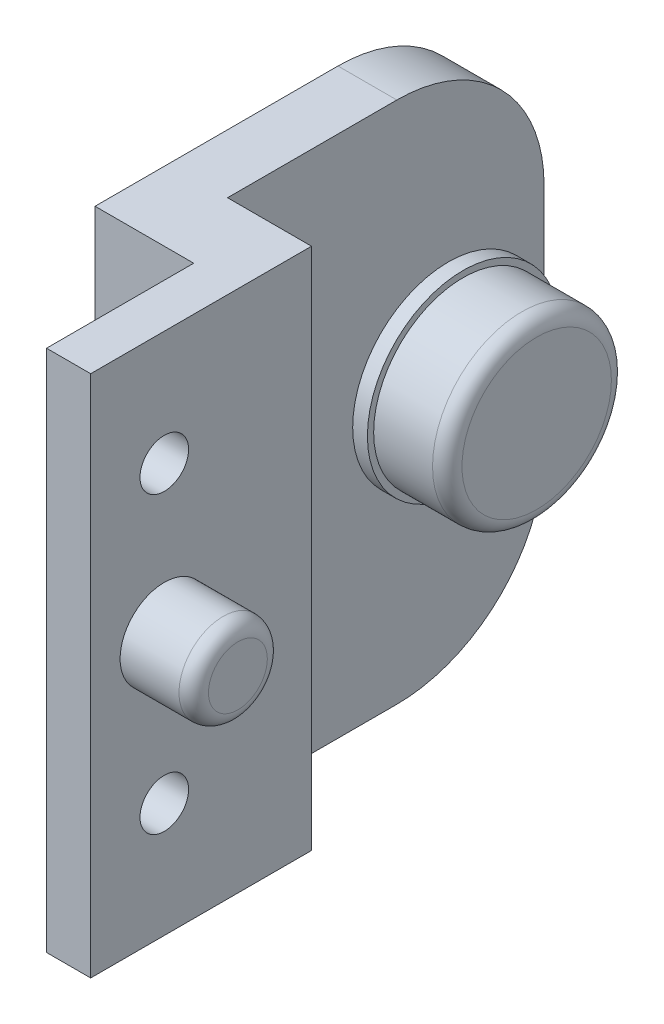
ISO-10303-21;
HEADER;
FILE_DESCRIPTION(('STEP AP214'),'2;1');
FILE_NAME('part.step','',(''),(''),'','','');
FILE_SCHEMA(('AUTOMOTIVE_DESIGN { 1 0 10303 214 1 1 1 1 }'));
ENDSEC;
DATA;
#1=APPLICATION_CONTEXT('core data for automotive mechanical design processes');
#2=APPLICATION_PROTOCOL_DEFINITION('international standard','automotive_design',2000,#1);
#3=PRODUCT_CONTEXT('',#1,'mechanical');
#4=PRODUCT('Part','Part','',(#3));
#5=PRODUCT_RELATED_PRODUCT_CATEGORY('part','',(#4));
#6=PRODUCT_DEFINITION_FORMATION('','',#4);
#7=PRODUCT_DEFINITION_CONTEXT('part definition',#1,'design');
#8=PRODUCT_DEFINITION('design','',#6,#7);
#9=PRODUCT_DEFINITION_SHAPE('','',#8);
#10=(LENGTH_UNIT() NAMED_UNIT(*) SI_UNIT(.MILLI.,.METRE.));
#11=(NAMED_UNIT(*) PLANE_ANGLE_UNIT() SI_UNIT($,.RADIAN.));
#12=(NAMED_UNIT(*) SI_UNIT($,.STERADIAN.) SOLID_ANGLE_UNIT());
#13=UNCERTAINTY_MEASURE_WITH_UNIT(LENGTH_MEASURE(1.E-05),#10,'distance_accuracy_value','');
#14=(GEOMETRIC_REPRESENTATION_CONTEXT(3) GLOBAL_UNCERTAINTY_ASSIGNED_CONTEXT((#13)) GLOBAL_UNIT_ASSIGNED_CONTEXT((#10,
#11,#12)) REPRESENTATION_CONTEXT('',''));
#15=CARTESIAN_POINT('',(0.,0.,0.));
#16=DIRECTION('',(0.,0.,1.));
#17=DIRECTION('',(1.,0.,0.));
#18=AXIS2_PLACEMENT_3D('',#15,#16,#17);
#19=CARTESIAN_POINT('',(0.,-18.275,23.55));
#20=DIRECTION('',(0.,-1.,0.));
#21=DIRECTION('',(0.,0.,-1.));
#22=AXIS2_PLACEMENT_3D('',#19,#20,#21);
#23=PLANE('',#22);
#24=DIRECTION('',(-1.,0.,0.));
#25=VECTOR('',#24,1.);
#26=CARTESIAN_POINT('',(-18.25,-18.275,-5.));
#27=LINE('',#26,#25);
#28=CARTESIAN_POINT('',(-12.5467811820916,-18.275,-5.));
#29=VERTEX_POINT('',#28);
#30=CARTESIAN_POINT('',(-18.25,-18.275,-5.));
#31=VERTEX_POINT('',#30);
#32=EDGE_CURVE('E175',#29,#31,#27,.T.);
#33=ORIENTED_EDGE('',*,*,#32,.F.);
#34=DIRECTION('',(0.,0.,1.));
#35=VECTOR('',#34,1.);
#36=CARTESIAN_POINT('',(-12.5467811820916,-18.275,-11.8050142221895));
#37=LINE('',#36,#35);
#38=CARTESIAN_POINT('',(-12.5467811820916,-18.275,10.));
#39=VERTEX_POINT('',#38);
#40=EDGE_CURVE('E67',#29,#39,#37,.T.);
#41=ORIENTED_EDGE('',*,*,#40,.T.);
#42=DIRECTION('',(1.,0.,0.));
#43=VECTOR('',#42,1.);
#44=CARTESIAN_POINT('',(-12.5467811820916,-18.275,10.));
#45=LINE('',#44,#43);
#46=CARTESIAN_POINT('',(-15.5467811820916,-18.275,10.));
#47=VERTEX_POINT('',#46);
#48=EDGE_CURVE('E143',#47,#39,#45,.T.);
#49=ORIENTED_EDGE('',*,*,#48,.F.);
#50=DIRECTION('',(0.,0.,-1.));
#51=VECTOR('',#50,1.);
#52=CARTESIAN_POINT('',(-15.5467811820916,-18.275,10.));
#53=LINE('',#52,#51);
#54=CARTESIAN_POINT('',(-15.5467811820916,-18.275,0.));
#55=VERTEX_POINT('',#54);
#56=EDGE_CURVE('E152',#47,#55,#53,.T.);
#57=ORIENTED_EDGE('',*,*,#56,.T.);
#58=DIRECTION('',(1.,0.,0.));
#59=VECTOR('',#58,1.);
#60=CARTESIAN_POINT('',(22.25,-18.275,0.));
#61=LINE('',#60,#59);
#62=CARTESIAN_POINT('',(-22.25,-18.275,0.));
#63=VERTEX_POINT('',#62);
#64=EDGE_CURVE('E178',#63,#55,#61,.T.);
#65=ORIENTED_EDGE('',*,*,#64,.F.);
#66=DIRECTION('',(0.,0.,1.));
#67=VECTOR('',#66,1.);
#68=CARTESIAN_POINT('',(-22.25,-18.275,0.));
#69=LINE('',#68,#67);
#70=CARTESIAN_POINT('',(-22.25,-18.275,-16.5));
#71=VERTEX_POINT('',#70);
#72=EDGE_CURVE('E181',#71,#63,#69,.T.);
#73=ORIENTED_EDGE('',*,*,#72,.F.);
#74=DIRECTION('',(-1.,0.,0.));
#75=VECTOR('',#74,1.);
#76=CARTESIAN_POINT('',(0.,-18.275,-16.5));
#77=LINE('',#76,#75);
#78=CARTESIAN_POINT('',(-18.25,-18.275,-16.5));
#79=VERTEX_POINT('',#78);
#80=EDGE_CURVE('E183',#71,#79,#77,.F.);
#81=ORIENTED_EDGE('',*,*,#80,.T.);
#82=DIRECTION('',(0.,0.,-1.));
#83=VECTOR('',#82,1.);
#84=CARTESIAN_POINT('',(-18.25,-18.275,-26.5));
#85=LINE('',#84,#83);
#86=EDGE_CURVE('E188',#31,#79,#85,.T.);
#87=ORIENTED_EDGE('',*,*,#86,.F.);
#88=EDGE_LOOP('',(#33,#41,#49,#57,#65,#73,#81,#87));
#89=FACE_BOUND('',#88,.T.);
#90=ADVANCED_FACE('F41',(#89),#23,.T.);
#91=CARTESIAN_POINT('',(0.,17.275,23.55));
#92=DIRECTION('',(0.,1.,0.));
#93=DIRECTION('',(0.,0.,1.));
#94=AXIS2_PLACEMENT_3D('',#91,#92,#93);
#95=PLANE('',#94);
#96=DIRECTION('',(0.,0.,1.));
#97=VECTOR('',#96,1.);
#98=CARTESIAN_POINT('',(-12.5467811820916,17.275,-11.8050142221895));
#99=LINE('',#98,#97);
#100=CARTESIAN_POINT('',(-12.5467811820916,17.275,-5.));
#101=VERTEX_POINT('',#100);
#102=CARTESIAN_POINT('',(-12.5467811820916,17.275,10.));
#103=VERTEX_POINT('',#102);
#104=EDGE_CURVE('E125',#101,#103,#99,.T.);
#105=ORIENTED_EDGE('',*,*,#104,.F.);
#106=DIRECTION('',(-1.,0.,0.));
#107=VECTOR('',#106,1.);
#108=CARTESIAN_POINT('',(-18.25,17.275,-5.));
#109=LINE('',#108,#107);
#110=CARTESIAN_POINT('',(-18.25,17.275,-5.));
#111=VERTEX_POINT('',#110);
#112=EDGE_CURVE('E169',#101,#111,#109,.T.);
#113=ORIENTED_EDGE('',*,*,#112,.T.);
#114=DIRECTION('',(0.,0.,-1.));
#115=VECTOR('',#114,1.);
#116=CARTESIAN_POINT('',(-18.25,17.275,-26.5));
#117=LINE('',#116,#115);
#118=CARTESIAN_POINT('',(-18.25,17.275,-16.5));
#119=VERTEX_POINT('',#118);
#120=EDGE_CURVE('E174',#111,#119,#117,.T.);
#121=ORIENTED_EDGE('',*,*,#120,.T.);
#122=DIRECTION('',(-1.,0.,0.));
#123=VECTOR('',#122,1.);
#124=CARTESIAN_POINT('',(0.,17.275,-16.5));
#125=LINE('',#124,#123);
#126=CARTESIAN_POINT('',(-22.25,17.275,-16.5));
#127=VERTEX_POINT('',#126);
#128=EDGE_CURVE('E199',#119,#127,#125,.T.);
#129=ORIENTED_EDGE('',*,*,#128,.T.);
#130=DIRECTION('',(0.,0.,1.));
#131=VECTOR('',#130,1.);
#132=CARTESIAN_POINT('',(-22.25,17.275,0.));
#133=LINE('',#132,#131);
#134=CARTESIAN_POINT('',(-22.25,17.275,0.));
#135=VERTEX_POINT('',#134);
#136=EDGE_CURVE('E171',#127,#135,#133,.T.);
#137=ORIENTED_EDGE('',*,*,#136,.T.);
#138=DIRECTION('',(1.,0.,0.));
#139=VECTOR('',#138,1.);
#140=CARTESIAN_POINT('',(22.25,17.275,0.));
#141=LINE('',#140,#139);
#142=CARTESIAN_POINT('',(-15.5467811820916,17.275,0.));
#143=VERTEX_POINT('',#142);
#144=EDGE_CURVE('E166',#135,#143,#141,.T.);
#145=ORIENTED_EDGE('',*,*,#144,.T.);
#146=DIRECTION('',(0.,0.,-1.));
#147=VECTOR('',#146,1.);
#148=CARTESIAN_POINT('',(-15.5467811820916,17.275,10.));
#149=LINE('',#148,#147);
#150=CARTESIAN_POINT('',(-15.5467811820916,17.275,10.));
#151=VERTEX_POINT('',#150);
#152=EDGE_CURVE('E129',#151,#143,#149,.T.);
#153=ORIENTED_EDGE('',*,*,#152,.F.);
#154=DIRECTION('',(-1.,0.,0.));
#155=VECTOR('',#154,1.);
#156=CARTESIAN_POINT('',(-12.5467811820916,17.275,10.));
#157=LINE('',#156,#155);
#158=EDGE_CURVE('E134',#103,#151,#157,.T.);
#159=ORIENTED_EDGE('',*,*,#158,.F.);
#160=EDGE_LOOP('',(#105,#113,#121,#129,#137,#145,#153,#159));
#161=FACE_BOUND('',#160,.T.);
#162=ADVANCED_FACE('F131',(#161),#95,.T.);
#163=CARTESIAN_POINT('',(-18.25,-70.0678566503142,-5.));
#164=DIRECTION('',(0.,0.,-1.));
#165=DIRECTION('',(-1.,0.,0.));
#166=AXIS2_PLACEMENT_3D('',#163,#164,#165);
#167=PLANE('',#166);
#168=DIRECTION('',(0.,1.,0.));
#169=VECTOR('',#168,1.);
#170=CARTESIAN_POINT('',(-12.5467811820916,-70.0678566503142,-5.));
#171=LINE('',#170,#169);
#172=EDGE_CURVE('E130',#29,#101,#171,.T.);
#173=ORIENTED_EDGE('',*,*,#172,.F.);
#174=ORIENTED_EDGE('',*,*,#32,.T.);
#175=DIRECTION('',(0.,1.,0.));
#176=VECTOR('',#175,1.);
#177=CARTESIAN_POINT('',(-18.25,-70.0678566503142,-5.));
#178=LINE('',#177,#176);
#179=EDGE_CURVE('E187',#31,#111,#178,.T.);
#180=ORIENTED_EDGE('',*,*,#179,.T.);
#181=ORIENTED_EDGE('',*,*,#112,.F.);
#182=EDGE_LOOP('',(#173,#174,#180,#181));
#183=FACE_BOUND('',#182,.T.);
#184=ADVANCED_FACE('F258',(#183),#167,.T.);
#185=CARTESIAN_POINT('',(-18.25,-70.0678566503142,-26.5));
#186=DIRECTION('',(1.,0.,0.));
#187=DIRECTION('',(0.,0.,-1.));
#188=AXIS2_PLACEMENT_3D('',#185,#186,#187);
#189=PLANE('',#188);
#190=DIRECTION('',(0.,1.,0.));
#191=VECTOR('',#190,1.);
#192=CARTESIAN_POINT('',(-18.25,-70.0678566503142,-26.5));
#193=LINE('',#192,#191);
#194=CARTESIAN_POINT('',(-18.25,-8.275,-26.5));
#195=VERTEX_POINT('',#194);
#196=CARTESIAN_POINT('',(-18.25,-0.499999999999999,-26.5));
#197=VERTEX_POINT('',#196);
#198=EDGE_CURVE('E194',#195,#197,#193,.T.);
#199=ORIENTED_EDGE('',*,*,#198,.T.);
#200=CARTESIAN_POINT('',(-18.25,-0.499999999999999,-20.));
#201=DIRECTION('',(1.,0.,0.));
#202=DIRECTION('',(0.,0.,-1.));
#203=AXIS2_PLACEMENT_3D('',#200,#201,#202);
#204=CIRCLE('',#203,6.5);
#205=EDGE_CURVE('E167',#197,#197,#204,.T.);
#206=ORIENTED_EDGE('',*,*,#205,.F.);
#207=CARTESIAN_POINT('',(-18.25,7.275,-26.5));
#208=VERTEX_POINT('',#207);
#209=EDGE_CURVE('E189',#197,#208,#193,.T.);
#210=ORIENTED_EDGE('',*,*,#209,.T.);
#211=CARTESIAN_POINT('',(-18.25,7.275,-16.5));
#212=DIRECTION('',(1.,0.,0.));
#213=DIRECTION('',(0.,0.,-1.));
#214=AXIS2_PLACEMENT_3D('',#211,#212,#213);
#215=CIRCLE('',#214,10.);
#216=EDGE_CURVE('E164',#208,#119,#215,.T.);
#217=ORIENTED_EDGE('',*,*,#216,.T.);
#218=ORIENTED_EDGE('',*,*,#120,.F.);
#219=ORIENTED_EDGE('',*,*,#179,.F.);
#220=ORIENTED_EDGE('',*,*,#86,.T.);
#221=CARTESIAN_POINT('',(-18.25,-8.275,-16.5));
#222=DIRECTION('',(1.,0.,0.));
#223=DIRECTION('',(0.,0.,-1.));
#224=AXIS2_PLACEMENT_3D('',#221,#222,#223);
#225=CIRCLE('',#224,10.);
#226=EDGE_CURVE('E211',#79,#195,#225,.T.);
#227=ORIENTED_EDGE('',*,*,#226,.T.);
#228=EDGE_LOOP('',(#199,#206,#210,#217,#218,#219,#220,#227));
#229=FACE_BOUND('',#228,.T.);
#230=ADVANCED_FACE('F314',(#229),#189,.T.);
#231=CARTESIAN_POINT('',(-22.25,-70.0678566503142,-26.5));
#232=DIRECTION('',(0.,0.,-1.));
#233=DIRECTION('',(-1.,0.,0.));
#234=AXIS2_PLACEMENT_3D('',#231,#232,#233);
#235=PLANE('',#234);
#236=DIRECTION('',(0.,1.,0.));
#237=VECTOR('',#236,1.);
#238=CARTESIAN_POINT('',(-22.25,-70.0678566503142,-26.5));
#239=LINE('',#238,#237);
#240=CARTESIAN_POINT('',(-22.25,-8.275,-26.5));
#241=VERTEX_POINT('',#240);
#242=CARTESIAN_POINT('',(-22.25,7.275,-26.5));
#243=VERTEX_POINT('',#242);
#244=EDGE_CURVE('E184',#241,#243,#239,.T.);
#245=ORIENTED_EDGE('',*,*,#244,.T.);
#246=DIRECTION('',(-1.,0.,0.));
#247=VECTOR('',#246,1.);
#248=CARTESIAN_POINT('',(-22.25,7.275,-26.5));
#249=LINE('',#248,#247);
#250=EDGE_CURVE('E212',#243,#208,#249,.F.);
#251=ORIENTED_EDGE('',*,*,#250,.T.);
#252=ORIENTED_EDGE('',*,*,#209,.F.);
#253=ORIENTED_EDGE('',*,*,#198,.F.);
#254=DIRECTION('',(-1.,0.,0.));
#255=VECTOR('',#254,1.);
#256=CARTESIAN_POINT('',(-22.25,-8.275,-26.5));
#257=LINE('',#256,#255);
#258=EDGE_CURVE('E209',#195,#241,#257,.T.);
#259=ORIENTED_EDGE('',*,*,#258,.T.);
#260=EDGE_LOOP('',(#245,#251,#252,#253,#259));
#261=FACE_BOUND('',#260,.T.);
#262=ADVANCED_FACE('F309',(#261),#235,.T.);
#263=CARTESIAN_POINT('',(-22.25,-70.0678566503142,0.));
#264=DIRECTION('',(-1.,0.,0.));
#265=DIRECTION('',(0.,0.,1.));
#266=AXIS2_PLACEMENT_3D('',#263,#264,#265);
#267=PLANE('',#266);
#268=CARTESIAN_POINT('',(-22.25,7.275,-16.5));
#269=DIRECTION('',(-1.,0.,0.));
#270=DIRECTION('',(0.,0.,1.));
#271=AXIS2_PLACEMENT_3D('',#268,#269,#270);
#272=CIRCLE('',#271,10.);
#273=EDGE_CURVE('E204',#127,#243,#272,.T.);
#274=ORIENTED_EDGE('',*,*,#273,.T.);
#275=ORIENTED_EDGE('',*,*,#244,.F.);
#276=CARTESIAN_POINT('',(-22.25,-8.275,-16.5));
#277=DIRECTION('',(-1.,0.,0.));
#278=DIRECTION('',(0.,0.,1.));
#279=AXIS2_PLACEMENT_3D('',#276,#277,#278);
#280=CIRCLE('',#279,10.);
#281=EDGE_CURVE('E202',#241,#71,#280,.T.);
#282=ORIENTED_EDGE('',*,*,#281,.T.);
#283=ORIENTED_EDGE('',*,*,#72,.T.);
#284=DIRECTION('',(0.,1.,0.));
#285=VECTOR('',#284,1.);
#286=CARTESIAN_POINT('',(-22.25,-70.0678566503142,0.));
#287=LINE('',#286,#285);
#288=EDGE_CURVE('E182',#63,#135,#287,.T.);
#289=ORIENTED_EDGE('',*,*,#288,.T.);
#290=ORIENTED_EDGE('',*,*,#136,.F.);
#291=EDGE_LOOP('',(#274,#275,#282,#283,#289,#290));
#292=FACE_BOUND('',#291,.T.);
#293=ADVANCED_FACE('F310',(#292),#267,.T.);
#294=CARTESIAN_POINT('',(22.25,-70.0678566503142,0.));
#295=DIRECTION('',(0.,0.,1.));
#296=DIRECTION('',(1.,0.,0.));
#297=AXIS2_PLACEMENT_3D('',#294,#295,#296);
#298=PLANE('',#297);
#299=DIRECTION('',(0.,-1.,0.));
#300=VECTOR('',#299,1.);
#301=CARTESIAN_POINT('',(-15.5467811820916,17.275,0.));
#302=LINE('',#301,#300);
#303=EDGE_CURVE('E59',#143,#55,#302,.T.);
#304=ORIENTED_EDGE('',*,*,#303,.F.);
#305=ORIENTED_EDGE('',*,*,#144,.F.);
#306=ORIENTED_EDGE('',*,*,#288,.F.);
#307=ORIENTED_EDGE('',*,*,#64,.T.);
#308=EDGE_LOOP('',(#304,#305,#306,#307));
#309=FACE_BOUND('',#308,.T.);
#310=ADVANCED_FACE('F262',(#309),#298,.T.);
#311=CARTESIAN_POINT('',(0.,7.275,-16.5));
#312=DIRECTION('',(-1.,0.,0.));
#313=DIRECTION('',(0.,0.,1.));
#314=AXIS2_PLACEMENT_3D('',#311,#312,#313);
#315=CYLINDRICAL_SURFACE('',#314,10.);
#316=ORIENTED_EDGE('',*,*,#216,.F.);
#317=ORIENTED_EDGE('',*,*,#250,.F.);
#318=ORIENTED_EDGE('',*,*,#273,.F.);
#319=ORIENTED_EDGE('',*,*,#128,.F.);
#320=EDGE_LOOP('',(#316,#317,#318,#319));
#321=FACE_BOUND('',#320,.T.);
#322=ADVANCED_FACE('F263',(#321),#315,.T.);
#323=CARTESIAN_POINT('',(-22.25,-8.275,-16.5));
#324=DIRECTION('',(-1.,0.,0.));
#325=DIRECTION('',(0.,0.,1.));
#326=AXIS2_PLACEMENT_3D('',#323,#324,#325);
#327=CYLINDRICAL_SURFACE('',#326,10.);
#328=ORIENTED_EDGE('',*,*,#226,.F.);
#329=ORIENTED_EDGE('',*,*,#80,.F.);
#330=ORIENTED_EDGE('',*,*,#281,.F.);
#331=ORIENTED_EDGE('',*,*,#258,.F.);
#332=EDGE_LOOP('',(#328,#329,#330,#331));
#333=FACE_BOUND('',#332,.T.);
#334=ADVANCED_FACE('F264',(#333),#327,.T.);
#335=CARTESIAN_POINT('',(-17.25,-0.499999999999999,-20.));
#336=DIRECTION('',(-1.,0.,0.));
#337=DIRECTION('',(0.,0.,1.));
#338=AXIS2_PLACEMENT_3D('',#335,#336,#337);
#339=CYLINDRICAL_SURFACE('',#338,6.5);
#340=ORIENTED_EDGE('',*,*,#205,.T.);
#341=EDGE_LOOP('',(#340));
#342=FACE_BOUND('',#341,.T.);
#343=CARTESIAN_POINT('',(-17.25,-0.499999999999999,-20.));
#344=DIRECTION('',(-1.,0.,0.));
#345=DIRECTION('',(0.,0.,1.));
#346=AXIS2_PLACEMENT_3D('',#343,#344,#345);
#347=CIRCLE('',#346,6.5);
#348=CARTESIAN_POINT('',(-17.25,-0.499999999999999,-13.5));
#349=VERTEX_POINT('',#348);
#350=EDGE_CURVE('E160',#349,#349,#347,.T.);
#351=ORIENTED_EDGE('',*,*,#350,.T.);
#352=EDGE_LOOP('',(#351));
#353=FACE_BOUND('',#352,.T.);
#354=ADVANCED_FACE('F268',(#342,#353),#339,.T.);
#355=CARTESIAN_POINT('',(-17.25,-0.499999999999999,-20.));
#356=DIRECTION('',(-1.,0.,0.));
#357=DIRECTION('',(0.,0.,1.));
#358=AXIS2_PLACEMENT_3D('',#355,#356,#357);
#359=PLANE('',#358);
#360=CARTESIAN_POINT('',(-17.25,-0.499999999999999,-20.));
#361=DIRECTION('',(1.,0.,0.));
#362=DIRECTION('',(0.,0.,-1.));
#363=AXIS2_PLACEMENT_3D('',#360,#361,#362);
#364=CIRCLE('',#363,6.075);
#365=CARTESIAN_POINT('',(-17.25,-0.499999999999999,-26.075));
#366=VERTEX_POINT('',#365);
#367=EDGE_CURVE('E159',#366,#366,#364,.T.);
#368=ORIENTED_EDGE('',*,*,#367,.F.);
#369=EDGE_LOOP('',(#368));
#370=FACE_BOUND('',#369,.T.);
#371=ORIENTED_EDGE('',*,*,#350,.F.);
#372=EDGE_LOOP('',(#371));
#373=FACE_BOUND('',#372,.T.);
#374=ADVANCED_FACE('F286',(#370,#373),#359,.F.);
#375=CARTESIAN_POINT('',(-12.25,-0.499999999999999,-20.));
#376=DIRECTION('',(-1.,0.,0.));
#377=DIRECTION('',(0.,0.,1.));
#378=AXIS2_PLACEMENT_3D('',#375,#376,#377);
#379=CYLINDRICAL_SURFACE('',#378,6.075);
#380=CARTESIAN_POINT('',(-13.25,-0.499999999999999,-20.));
#381=DIRECTION('',(1.,0.,0.));
#382=DIRECTION('',(0.,0.,-1.));
#383=AXIS2_PLACEMENT_3D('',#380,#381,#382);
#384=CIRCLE('',#383,6.075);
#385=CARTESIAN_POINT('',(-13.25,-0.499999999999999,-26.075));
#386=VERTEX_POINT('',#385);
#387=EDGE_CURVE('E219',#386,#386,#384,.F.);
#388=ORIENTED_EDGE('',*,*,#387,.T.);
#389=EDGE_LOOP('',(#388));
#390=FACE_BOUND('',#389,.T.);
#391=ORIENTED_EDGE('',*,*,#367,.T.);
#392=EDGE_LOOP('',(#391));
#393=FACE_BOUND('',#392,.T.);
#394=ADVANCED_FACE('F279',(#390,#393),#379,.T.);
#395=CARTESIAN_POINT('',(-12.25,-0.499999999999999,-20.));
#396=DIRECTION('',(1.,0.,0.));
#397=DIRECTION('',(0.,0.,-1.));
#398=AXIS2_PLACEMENT_3D('',#395,#396,#397);
#399=PLANE('',#398);
#400=CARTESIAN_POINT('',(-12.25,-0.499999999999999,-20.));
#401=DIRECTION('',(1.,0.,0.));
#402=DIRECTION('',(0.,0.,-1.));
#403=AXIS2_PLACEMENT_3D('',#400,#401,#402);
#404=CIRCLE('',#403,5.075);
#405=CARTESIAN_POINT('',(-12.25,-0.499999999999999,-25.075));
#406=VERTEX_POINT('',#405);
#407=EDGE_CURVE('E165',#406,#406,#404,.T.);
#408=ORIENTED_EDGE('',*,*,#407,.T.);
#409=EDGE_LOOP('',(#408));
#410=FACE_BOUND('',#409,.T.);
#411=ADVANCED_FACE('F275',(#410),#399,.T.);
#412=CARTESIAN_POINT('',(-13.25,-0.499999999999999,-20.));
#413=DIRECTION('',(1.,0.,0.));
#414=DIRECTION('',(0.,0.,-1.));
#415=AXIS2_PLACEMENT_3D('',#412,#413,#414);
#416=TOROIDAL_SURFACE('',#415,5.075,1.);
#417=ORIENTED_EDGE('',*,*,#387,.F.);
#418=EDGE_LOOP('',(#417));
#419=FACE_BOUND('',#418,.T.);
#420=ORIENTED_EDGE('',*,*,#407,.F.);
#421=EDGE_LOOP('',(#420));
#422=FACE_BOUND('',#421,.T.);
#423=ADVANCED_FACE('F269',(#419,#422),#416,.T.);
#424=CARTESIAN_POINT('',(-12.5467811820916,-18.275,-11.8050142221895));
#425=DIRECTION('',(-1.,0.,0.));
#426=DIRECTION('',(0.,0.,1.));
#427=AXIS2_PLACEMENT_3D('',#424,#425,#426);
#428=PLANE('',#427);
#429=CARTESIAN_POINT('',(-12.5467811820916,9.5,5.));
#430=DIRECTION('',(-1.,0.,0.));
#431=DIRECTION('',(0.,0.,1.));
#432=AXIS2_PLACEMENT_3D('',#429,#430,#431);
#433=CIRCLE('',#432,1.65);
#434=CARTESIAN_POINT('',(-12.5467811820916,9.5,6.65));
#435=VERTEX_POINT('',#434);
#436=EDGE_CURVE('E141',#435,#435,#433,.T.);
#437=ORIENTED_EDGE('',*,*,#436,.T.);
#438=EDGE_LOOP('',(#437));
#439=FACE_BOUND('',#438,.T.);
#440=CARTESIAN_POINT('',(-12.5467811820916,-10.5,5.));
#441=DIRECTION('',(-1.,0.,0.));
#442=DIRECTION('',(0.,0.,1.));
#443=AXIS2_PLACEMENT_3D('',#440,#441,#442);
#444=CIRCLE('',#443,1.65);
#445=CARTESIAN_POINT('',(-12.5467811820916,-10.5,6.65));
#446=VERTEX_POINT('',#445);
#447=EDGE_CURVE('E226',#446,#446,#444,.T.);
#448=ORIENTED_EDGE('',*,*,#447,.T.);
#449=EDGE_LOOP('',(#448));
#450=FACE_BOUND('',#449,.T.);
#451=CARTESIAN_POINT('',(-12.5467811820916,-0.499999999999997,5.));
#452=DIRECTION('',(1.,0.,0.));
#453=DIRECTION('',(0.,0.,-1.));
#454=AXIS2_PLACEMENT_3D('',#451,#452,#453);
#455=CIRCLE('',#454,3.);
#456=CARTESIAN_POINT('',(-12.5467811820916,-0.499999999999997,2.));
#457=VERTEX_POINT('',#456);
#458=EDGE_CURVE('E146',#457,#457,#455,.T.);
#459=ORIENTED_EDGE('',*,*,#458,.F.);
#460=EDGE_LOOP('',(#459));
#461=FACE_BOUND('',#460,.T.);
#462=ORIENTED_EDGE('',*,*,#40,.F.);
#463=ORIENTED_EDGE('',*,*,#172,.T.);
#464=ORIENTED_EDGE('',*,*,#104,.T.);
#465=DIRECTION('',(0.,1.,0.));
#466=VECTOR('',#465,1.);
#467=CARTESIAN_POINT('',(-12.5467811820916,17.275,10.));
#468=LINE('',#467,#466);
#469=EDGE_CURVE('E126',#39,#103,#468,.T.);
#470=ORIENTED_EDGE('',*,*,#469,.F.);
#471=EDGE_LOOP('',(#462,#463,#464,#470));
#472=FACE_BOUND('',#471,.T.);
#473=ADVANCED_FACE('F122',(#439,#450,#461,#472),#428,.F.);
#474=CARTESIAN_POINT('',(-15.5467811820916,17.275,10.));
#475=DIRECTION('',(1.,0.,0.));
#476=DIRECTION('',(0.,0.,-1.));
#477=AXIS2_PLACEMENT_3D('',#474,#475,#476);
#478=PLANE('',#477);
#479=CARTESIAN_POINT('',(-15.5467811820916,9.5,5.));
#480=DIRECTION('',(1.,0.,0.));
#481=DIRECTION('',(0.,0.,-1.));
#482=AXIS2_PLACEMENT_3D('',#479,#480,#481);
#483=CIRCLE('',#482,1.65);
#484=CARTESIAN_POINT('',(-15.5467811820916,9.5,3.35));
#485=VERTEX_POINT('',#484);
#486=EDGE_CURVE('E44',#485,#485,#483,.T.);
#487=ORIENTED_EDGE('',*,*,#486,.T.);
#488=EDGE_LOOP('',(#487));
#489=FACE_BOUND('',#488,.T.);
#490=CARTESIAN_POINT('',(-15.5467811820916,-10.5,5.));
#491=DIRECTION('',(1.,0.,0.));
#492=DIRECTION('',(0.,0.,-1.));
#493=AXIS2_PLACEMENT_3D('',#490,#491,#492);
#494=CIRCLE('',#493,1.65);
#495=CARTESIAN_POINT('',(-15.5467811820916,-10.5,3.35));
#496=VERTEX_POINT('',#495);
#497=EDGE_CURVE('E222',#496,#496,#494,.T.);
#498=ORIENTED_EDGE('',*,*,#497,.T.);
#499=EDGE_LOOP('',(#498));
#500=FACE_BOUND('',#499,.T.);
#501=ORIENTED_EDGE('',*,*,#303,.T.);
#502=ORIENTED_EDGE('',*,*,#56,.F.);
#503=DIRECTION('',(0.,-1.,0.));
#504=VECTOR('',#503,1.);
#505=CARTESIAN_POINT('',(-15.5467811820916,17.275,10.));
#506=LINE('',#505,#504);
#507=EDGE_CURVE('E139',#151,#47,#506,.T.);
#508=ORIENTED_EDGE('',*,*,#507,.F.);
#509=ORIENTED_EDGE('',*,*,#152,.T.);
#510=EDGE_LOOP('',(#501,#502,#508,#509));
#511=FACE_BOUND('',#510,.T.);
#512=ADVANCED_FACE('F277',(#489,#500,#511),#478,.F.);
#513=CARTESIAN_POINT('',(0.,0.,10.));
#514=DIRECTION('',(0.,0.,-1.));
#515=DIRECTION('',(-1.,0.,0.));
#516=AXIS2_PLACEMENT_3D('',#513,#514,#515);
#517=PLANE('',#516);
#518=ORIENTED_EDGE('',*,*,#469,.T.);
#519=ORIENTED_EDGE('',*,*,#158,.T.);
#520=ORIENTED_EDGE('',*,*,#507,.T.);
#521=ORIENTED_EDGE('',*,*,#48,.T.);
#522=EDGE_LOOP('',(#518,#519,#520,#521));
#523=FACE_BOUND('',#522,.T.);
#524=ADVANCED_FACE('F142',(#523),#517,.F.);
#525=CARTESIAN_POINT('',(-7.54678118209161,-0.499999999999997,5.));
#526=DIRECTION('',(-1.,0.,0.));
#527=DIRECTION('',(0.,0.,1.));
#528=AXIS2_PLACEMENT_3D('',#525,#526,#527);
#529=CYLINDRICAL_SURFACE('',#528,3.);
#530=CARTESIAN_POINT('',(-8.54678118209161,-0.499999999999997,5.));
#531=DIRECTION('',(1.,0.,0.));
#532=DIRECTION('',(0.,0.,-1.));
#533=AXIS2_PLACEMENT_3D('',#530,#531,#532);
#534=CIRCLE('',#533,3.);
#535=CARTESIAN_POINT('',(-8.54678118209161,-0.499999999999997,2.));
#536=VERTEX_POINT('',#535);
#537=EDGE_CURVE('E11',#536,#536,#534,.F.);
#538=ORIENTED_EDGE('',*,*,#537,.T.);
#539=EDGE_LOOP('',(#538));
#540=FACE_BOUND('',#539,.T.);
#541=ORIENTED_EDGE('',*,*,#458,.T.);
#542=EDGE_LOOP('',(#541));
#543=FACE_BOUND('',#542,.T.);
#544=ADVANCED_FACE('F344',(#540,#543),#529,.T.);
#545=CARTESIAN_POINT('',(-7.54678118209161,-0.499999999999997,5.));
#546=DIRECTION('',(1.,0.,0.));
#547=DIRECTION('',(0.,0.,-1.));
#548=AXIS2_PLACEMENT_3D('',#545,#546,#547);
#549=PLANE('',#548);
#550=CARTESIAN_POINT('',(-7.54678118209161,-0.499999999999997,5.));
#551=DIRECTION('',(1.,0.,0.));
#552=DIRECTION('',(0.,0.,-1.));
#553=AXIS2_PLACEMENT_3D('',#550,#551,#552);
#554=CIRCLE('',#553,2.);
#555=CARTESIAN_POINT('',(-7.54678118209161,-0.499999999999997,3.));
#556=VERTEX_POINT('',#555);
#557=EDGE_CURVE('E49',#556,#556,#554,.T.);
#558=ORIENTED_EDGE('',*,*,#557,.T.);
#559=EDGE_LOOP('',(#558));
#560=FACE_BOUND('',#559,.T.);
#561=ADVANCED_FACE('F349',(#560),#549,.T.);
#562=CARTESIAN_POINT('',(-8.54678118209161,-0.499999999999997,5.));
#563=DIRECTION('',(1.,0.,0.));
#564=DIRECTION('',(0.,0.,-1.));
#565=AXIS2_PLACEMENT_3D('',#562,#563,#564);
#566=TOROIDAL_SURFACE('',#565,2.,1.);
#567=ORIENTED_EDGE('',*,*,#537,.F.);
#568=EDGE_LOOP('',(#567));
#569=FACE_BOUND('',#568,.T.);
#570=ORIENTED_EDGE('',*,*,#557,.F.);
#571=EDGE_LOOP('',(#570));
#572=FACE_BOUND('',#571,.T.);
#573=ADVANCED_FACE('F43',(#569,#572),#566,.T.);
#574=CARTESIAN_POINT('',(-22.25,-10.5,5.));
#575=DIRECTION('',(1.,0.,0.));
#576=DIRECTION('',(0.,0.,-1.));
#577=AXIS2_PLACEMENT_3D('',#574,#575,#576);
#578=CYLINDRICAL_SURFACE('',#577,1.65);
#579=ORIENTED_EDGE('',*,*,#497,.F.);
#580=EDGE_LOOP('',(#579));
#581=FACE_BOUND('',#580,.T.);
#582=ORIENTED_EDGE('',*,*,#447,.F.);
#583=EDGE_LOOP('',(#582));
#584=FACE_BOUND('',#583,.T.);
#585=ADVANCED_FACE('F238',(#581,#584),#578,.F.);
#586=CARTESIAN_POINT('',(-22.25,9.5,5.));
#587=DIRECTION('',(1.,0.,0.));
#588=DIRECTION('',(0.,0.,-1.));
#589=AXIS2_PLACEMENT_3D('',#586,#587,#588);
#590=CYLINDRICAL_SURFACE('',#589,1.65);
#591=ORIENTED_EDGE('',*,*,#486,.F.);
#592=EDGE_LOOP('',(#591));
#593=FACE_BOUND('',#592,.T.);
#594=ORIENTED_EDGE('',*,*,#436,.F.);
#595=EDGE_LOOP('',(#594));
#596=FACE_BOUND('',#595,.T.);
#597=ADVANCED_FACE('F239',(#593,#596),#590,.F.);
#598=CLOSED_SHELL('',(#90,#162,#184,#230,#262,#293,#310,#322,#334,#354,#374,#394,#411,#423,#473,
#512,#524,#544,#561,#573,#585,#597));
#599=MANIFOLD_SOLID_BREP('B2',#598);
#600=ADVANCED_BREP_SHAPE_REPRESENTATION('',(#18,#599),#14);
#601=SHAPE_DEFINITION_REPRESENTATION(#9,#600);
ENDSEC;
END-ISO-10303-21;
